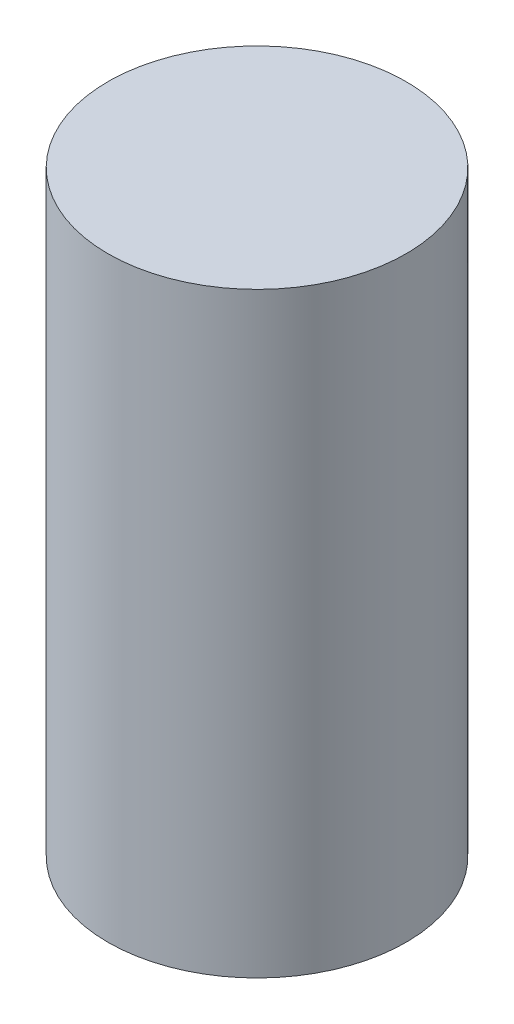
ISO-10303-21;
HEADER;
FILE_DESCRIPTION(('STEP AP214'),'2;1');
FILE_NAME('part.step','',(''),(''),'','','');
FILE_SCHEMA(('AUTOMOTIVE_DESIGN { 1 0 10303 214 1 1 1 1 }'));
ENDSEC;
DATA;
#1=APPLICATION_CONTEXT('core data for automotive mechanical design processes');
#2=APPLICATION_PROTOCOL_DEFINITION('international standard','automotive_design',2000,#1);
#3=PRODUCT_CONTEXT('',#1,'mechanical');
#4=PRODUCT('Part','Part','',(#3));
#5=PRODUCT_RELATED_PRODUCT_CATEGORY('part','',(#4));
#6=PRODUCT_DEFINITION_FORMATION('','',#4);
#7=PRODUCT_DEFINITION_CONTEXT('part definition',#1,'design');
#8=PRODUCT_DEFINITION('design','',#6,#7);
#9=PRODUCT_DEFINITION_SHAPE('','',#8);
#10=(LENGTH_UNIT() NAMED_UNIT(*) SI_UNIT(.MILLI.,.METRE.));
#11=(NAMED_UNIT(*) PLANE_ANGLE_UNIT() SI_UNIT($,.RADIAN.));
#12=(NAMED_UNIT(*) SI_UNIT($,.STERADIAN.) SOLID_ANGLE_UNIT());
#13=UNCERTAINTY_MEASURE_WITH_UNIT(LENGTH_MEASURE(1.E-05),#10,'distance_accuracy_value','');
#14=(GEOMETRIC_REPRESENTATION_CONTEXT(3) GLOBAL_UNCERTAINTY_ASSIGNED_CONTEXT((#13)) GLOBAL_UNIT_ASSIGNED_CONTEXT((#10,
#11,#12)) REPRESENTATION_CONTEXT('',''));
#15=CARTESIAN_POINT('',(0.,0.,0.));
#16=DIRECTION('',(0.,0.,1.));
#17=DIRECTION('',(1.,0.,0.));
#18=AXIS2_PLACEMENT_3D('',#15,#16,#17);
#19=CARTESIAN_POINT('',(0.,200.,0.));
#20=DIRECTION('',(0.,-1.,0.));
#21=DIRECTION('',(0.,0.,-1.));
#22=AXIS2_PLACEMENT_3D('',#19,#20,#21);
#23=CYLINDRICAL_SURFACE('',#22,50.);
#24=CARTESIAN_POINT('',(0.,200.,0.));
#25=DIRECTION('',(0.,1.,0.));
#26=DIRECTION('',(0.,0.,1.));
#27=AXIS2_PLACEMENT_3D('',#24,#25,#26);
#28=CIRCLE('',#27,50.);
#29=CARTESIAN_POINT('',(0.,200.,50.));
#30=VERTEX_POINT('',#29);
#31=EDGE_CURVE('E10',#30,#30,#28,.T.);
#32=ORIENTED_EDGE('',*,*,#31,.F.);
#33=EDGE_LOOP('',(#32));
#34=FACE_BOUND('',#33,.T.);
#35=CARTESIAN_POINT('',(0.,0.,0.));
#36=DIRECTION('',(0.,1.,0.));
#37=DIRECTION('',(0.,0.,1.));
#38=AXIS2_PLACEMENT_3D('',#35,#36,#37);
#39=CIRCLE('',#38,50.);
#40=CARTESIAN_POINT('',(0.,0.,50.));
#41=VERTEX_POINT('',#40);
#42=EDGE_CURVE('E38',#41,#41,#39,.T.);
#43=ORIENTED_EDGE('',*,*,#42,.T.);
#44=EDGE_LOOP('',(#43));
#45=FACE_BOUND('',#44,.T.);
#46=ADVANCED_FACE('F35',(#34,#45),#23,.T.);
#47=CARTESIAN_POINT('',(0.,200.,0.));
#48=DIRECTION('',(0.,1.,0.));
#49=DIRECTION('',(0.,0.,1.));
#50=AXIS2_PLACEMENT_3D('',#47,#48,#49);
#51=PLANE('',#50);
#52=ORIENTED_EDGE('',*,*,#31,.T.);
#53=EDGE_LOOP('',(#52));
#54=FACE_BOUND('',#53,.T.);
#55=ADVANCED_FACE('F50',(#54),#51,.T.);
#56=CARTESIAN_POINT('',(0.,0.,0.));
#57=DIRECTION('',(0.,1.,0.));
#58=DIRECTION('',(0.,0.,1.));
#59=AXIS2_PLACEMENT_3D('',#56,#57,#58);
#60=PLANE('',#59);
#61=ORIENTED_EDGE('',*,*,#42,.F.);
#62=EDGE_LOOP('',(#61));
#63=FACE_BOUND('',#62,.T.);
#64=ADVANCED_FACE('F48',(#63),#60,.F.);
#65=CLOSED_SHELL('',(#46,#55,#64));
#66=MANIFOLD_SOLID_BREP('B2',#65);
#67=ADVANCED_BREP_SHAPE_REPRESENTATION('',(#18,#66),#14);
#68=SHAPE_DEFINITION_REPRESENTATION(#9,#67);
ENDSEC;
END-ISO-10303-21;
